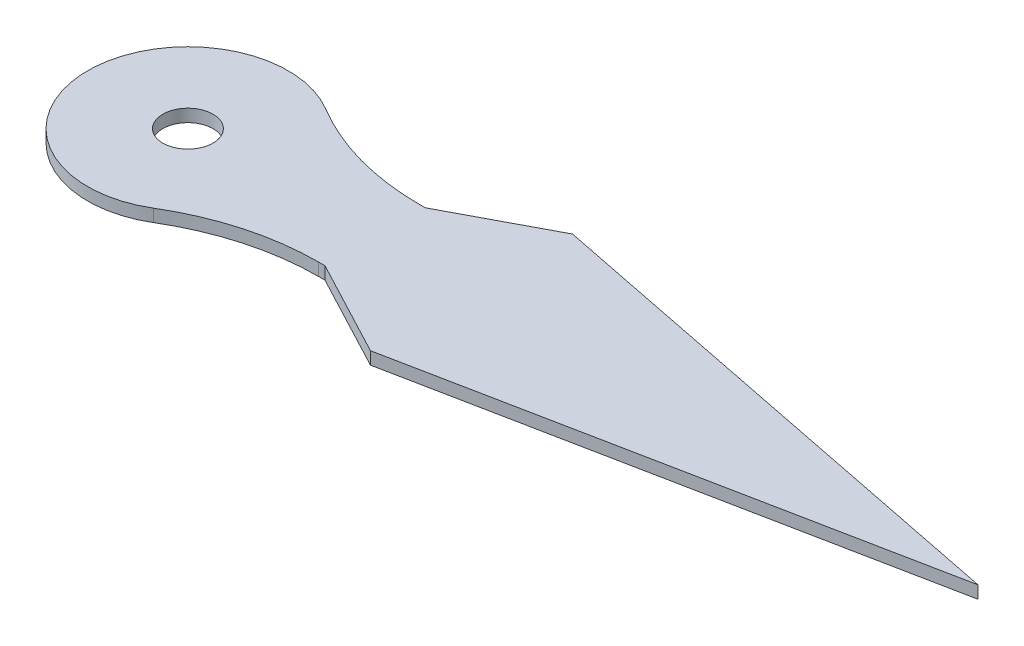
ISO-10303-21;
HEADER;
FILE_DESCRIPTION(('STEP AP214'),'2;1');
FILE_NAME('part.step','',(''),(''),'','','');
FILE_SCHEMA(('AUTOMOTIVE_DESIGN { 1 0 10303 214 1 1 1 1 }'));
ENDSEC;
DATA;
#1=APPLICATION_CONTEXT('core data for automotive mechanical design processes');
#2=APPLICATION_PROTOCOL_DEFINITION('international standard','automotive_design',2000,#1);
#3=PRODUCT_CONTEXT('',#1,'mechanical');
#4=PRODUCT('Part','Part','',(#3));
#5=PRODUCT_RELATED_PRODUCT_CATEGORY('part','',(#4));
#6=PRODUCT_DEFINITION_FORMATION('','',#4);
#7=PRODUCT_DEFINITION_CONTEXT('part definition',#1,'design');
#8=PRODUCT_DEFINITION('design','',#6,#7);
#9=PRODUCT_DEFINITION_SHAPE('','',#8);
#10=(LENGTH_UNIT() NAMED_UNIT(*) SI_UNIT(.MILLI.,.METRE.));
#11=(NAMED_UNIT(*) PLANE_ANGLE_UNIT() SI_UNIT($,.RADIAN.));
#12=(NAMED_UNIT(*) SI_UNIT($,.STERADIAN.) SOLID_ANGLE_UNIT());
#13=UNCERTAINTY_MEASURE_WITH_UNIT(LENGTH_MEASURE(1.E-05),#10,'distance_accuracy_value','');
#14=(GEOMETRIC_REPRESENTATION_CONTEXT(3) GLOBAL_UNCERTAINTY_ASSIGNED_CONTEXT((#13)) GLOBAL_UNIT_ASSIGNED_CONTEXT((#10,
#11,#12)) REPRESENTATION_CONTEXT('',''));
#15=CARTESIAN_POINT('',(0.,0.,0.));
#16=DIRECTION('',(0.,0.,1.));
#17=DIRECTION('',(1.,0.,0.));
#18=AXIS2_PLACEMENT_3D('',#15,#16,#17);
#19=CARTESIAN_POINT('',(0.,0.5,-2.00000000000001));
#20=DIRECTION('',(0.,0.,-1.));
#21=DIRECTION('',(-1.,0.,0.));
#22=AXIS2_PLACEMENT_3D('',#19,#20,#21);
#23=PLANE('',#22);
#24=DIRECTION('',(1.,0.,0.));
#25=VECTOR('',#24,1.);
#26=CARTESIAN_POINT('',(0.,0.,-2.00000000000001));
#27=LINE('',#26,#25);
#28=CARTESIAN_POINT('',(7.21110255092797,0.,-2.));
#29=VERTEX_POINT('',#28);
#30=CARTESIAN_POINT('',(7.46410161513775,0.,-2.));
#31=VERTEX_POINT('',#30);
#32=EDGE_CURVE('E138',#29,#31,#27,.T.);
#33=ORIENTED_EDGE('',*,*,#32,.F.);
#34=DIRECTION('',(0.,-1.,0.));
#35=VECTOR('',#34,1.);
#36=CARTESIAN_POINT('',(7.21110255092797,0.5,-2.));
#37=LINE('',#36,#35);
#38=CARTESIAN_POINT('',(7.21110255092797,0.5,-2.));
#39=VERTEX_POINT('',#38);
#40=EDGE_CURVE('E168',#29,#39,#37,.F.);
#41=ORIENTED_EDGE('',*,*,#40,.T.);
#42=DIRECTION('',(1.,0.,0.));
#43=VECTOR('',#42,1.);
#44=CARTESIAN_POINT('',(0.,0.5,-2.00000000000001));
#45=LINE('',#44,#43);
#46=CARTESIAN_POINT('',(7.46410161513775,0.5,-2.));
#47=VERTEX_POINT('',#46);
#48=EDGE_CURVE('E156',#39,#47,#45,.T.);
#49=ORIENTED_EDGE('',*,*,#48,.T.);
#50=DIRECTION('',(0.,-1.,0.));
#51=VECTOR('',#50,1.);
#52=CARTESIAN_POINT('',(7.46410161513775,0.5,-2.));
#53=LINE('',#52,#51);
#54=EDGE_CURVE('E137',#47,#31,#53,.T.);
#55=ORIENTED_EDGE('',*,*,#54,.T.);
#56=EDGE_LOOP('',(#33,#41,#49,#55));
#57=FACE_BOUND('',#56,.T.);
#58=ADVANCED_FACE('F36',(#57),#23,.T.);
#59=CARTESIAN_POINT('',(0.,0.5,0.));
#60=DIRECTION('',(0.,-1.,0.));
#61=DIRECTION('',(0.,0.,-1.));
#62=AXIS2_PLACEMENT_3D('',#59,#60,#61);
#63=CYLINDRICAL_SURFACE('',#62,4.);
#64=CARTESIAN_POINT('',(0.,0.5,0.));
#65=DIRECTION('',(0.,1.,0.));
#66=DIRECTION('',(0.,0.,1.));
#67=AXIS2_PLACEMENT_3D('',#64,#65,#66);
#68=CIRCLE('',#67,4.);
#69=CARTESIAN_POINT('',(2.06031501455085,0.5,-3.42857142857143));
#70=VERTEX_POINT('',#69);
#71=CARTESIAN_POINT('',(2.06031501455085,0.5,3.42857142857143));
#72=VERTEX_POINT('',#71);
#73=EDGE_CURVE('E111',#70,#72,#68,.T.);
#74=ORIENTED_EDGE('',*,*,#73,.F.);
#75=DIRECTION('',(0.,-1.,0.));
#76=VECTOR('',#75,1.);
#77=CARTESIAN_POINT('',(2.06031501455085,0.5,-3.42857142857143));
#78=LINE('',#77,#76);
#79=CARTESIAN_POINT('',(2.06031501455085,0.,-3.42857142857143));
#80=VERTEX_POINT('',#79);
#81=EDGE_CURVE('E165',#70,#80,#78,.T.);
#82=ORIENTED_EDGE('',*,*,#81,.T.);
#83=CARTESIAN_POINT('',(0.,0.,0.));
#84=DIRECTION('',(0.,1.,0.));
#85=DIRECTION('',(0.,0.,1.));
#86=AXIS2_PLACEMENT_3D('',#83,#84,#85);
#87=CIRCLE('',#86,4.);
#88=CARTESIAN_POINT('',(2.06031501455085,0.,3.42857142857143));
#89=VERTEX_POINT('',#88);
#90=EDGE_CURVE('E140',#80,#89,#87,.T.);
#91=ORIENTED_EDGE('',*,*,#90,.T.);
#92=DIRECTION('',(0.,-1.,0.));
#93=VECTOR('',#92,1.);
#94=CARTESIAN_POINT('',(2.06031501455085,0.5,3.42857142857143));
#95=LINE('',#94,#93);
#96=EDGE_CURVE('E120',#89,#72,#95,.F.);
#97=ORIENTED_EDGE('',*,*,#96,.T.);
#98=EDGE_LOOP('',(#74,#82,#91,#97));
#99=FACE_BOUND('',#98,.T.);
#100=ADVANCED_FACE('F180',(#99),#63,.T.);
#101=CARTESIAN_POINT('',(0.,0.5,2.));
#102=DIRECTION('',(0.,0.,-1.));
#103=DIRECTION('',(-1.,0.,0.));
#104=AXIS2_PLACEMENT_3D('',#101,#102,#103);
#105=PLANE('',#104);
#106=DIRECTION('',(1.,0.,0.));
#107=VECTOR('',#106,1.);
#108=CARTESIAN_POINT('',(0.,0.5,2.));
#109=LINE('',#108,#107);
#110=CARTESIAN_POINT('',(7.21110255092797,0.5,2.));
#111=VERTEX_POINT('',#110);
#112=CARTESIAN_POINT('',(7.46410161513775,0.5,2.00000000000001));
#113=VERTEX_POINT('',#112);
#114=EDGE_CURVE('E103',#111,#113,#109,.T.);
#115=ORIENTED_EDGE('',*,*,#114,.F.);
#116=DIRECTION('',(0.,1.,0.));
#117=VECTOR('',#116,1.);
#118=CARTESIAN_POINT('',(7.21110255092797,0.,2.));
#119=LINE('',#118,#117);
#120=CARTESIAN_POINT('',(7.21110255092797,0.,2.));
#121=VERTEX_POINT('',#120);
#122=EDGE_CURVE('E170',#111,#121,#119,.F.);
#123=ORIENTED_EDGE('',*,*,#122,.T.);
#124=DIRECTION('',(1.,0.,0.));
#125=VECTOR('',#124,1.);
#126=CARTESIAN_POINT('',(0.,0.,2.));
#127=LINE('',#126,#125);
#128=CARTESIAN_POINT('',(7.46410161513775,0.,2.00000000000001));
#129=VERTEX_POINT('',#128);
#130=EDGE_CURVE('E117',#121,#129,#127,.T.);
#131=ORIENTED_EDGE('',*,*,#130,.T.);
#132=DIRECTION('',(0.,-1.,0.));
#133=VECTOR('',#132,1.);
#134=CARTESIAN_POINT('',(7.46410161513775,0.5,2.00000000000001));
#135=LINE('',#134,#133);
#136=EDGE_CURVE('E114',#113,#129,#135,.T.);
#137=ORIENTED_EDGE('',*,*,#136,.F.);
#138=EDGE_LOOP('',(#115,#123,#131,#137));
#139=FACE_BOUND('',#138,.T.);
#140=ADVANCED_FACE('F115',(#139),#105,.F.);
#141=CARTESIAN_POINT('',(0.801892589521018,0.5,-1.51840744270702));
#142=DIRECTION('',(0.46699130377851,0.,-0.884261908144441));
#143=DIRECTION('',(-0.884261908144441,0.,-0.46699130377851));
#144=AXIS2_PLACEMENT_3D('',#141,#142,#143);
#145=PLANE('',#144);
#146=DIRECTION('',(0.884261908144441,0.,0.46699130377851));
#147=VECTOR('',#146,1.);
#148=CARTESIAN_POINT('',(0.801892589521018,0.,-1.51840744270702));
#149=LINE('',#148,#147);
#150=CARTESIAN_POINT('',(11.302617333086,0.,4.02717480328935));
#151=VERTEX_POINT('',#150);
#152=EDGE_CURVE('E145',#129,#151,#149,.T.);
#153=ORIENTED_EDGE('',*,*,#152,.T.);
#154=DIRECTION('',(0.,-1.,0.));
#155=VECTOR('',#154,1.);
#156=CARTESIAN_POINT('',(11.302617333086,0.5,4.02717480328935));
#157=LINE('',#156,#155);
#158=CARTESIAN_POINT('',(11.302617333086,0.5,4.02717480328935));
#159=VERTEX_POINT('',#158);
#160=EDGE_CURVE('E121',#159,#151,#157,.T.);
#161=ORIENTED_EDGE('',*,*,#160,.F.);
#162=DIRECTION('',(0.884261908144441,0.,0.46699130377851));
#163=VECTOR('',#162,1.);
#164=CARTESIAN_POINT('',(0.801892589521018,0.5,-1.51840744270702));
#165=LINE('',#164,#163);
#166=EDGE_CURVE('E108',#113,#159,#165,.T.);
#167=ORIENTED_EDGE('',*,*,#166,.F.);
#168=ORIENTED_EDGE('',*,*,#136,.T.);
#169=EDGE_LOOP('',(#153,#161,#167,#168));
#170=FACE_BOUND('',#169,.T.);
#171=ADVANCED_FACE('F123',(#170),#145,.F.);
#172=CARTESIAN_POINT('',(1.20499180331526,0.5,6.04125300598459));
#173=DIRECTION('',(-0.195607451328278,0.,-0.980682275247623));
#174=DIRECTION('',(-0.980682275247623,0.,0.195607451328278));
#175=AXIS2_PLACEMENT_3D('',#172,#173,#174);
#176=PLANE('',#175);
#177=DIRECTION('',(0.980682275247623,0.,-0.195607451328278));
#178=VECTOR('',#177,1.);
#179=CARTESIAN_POINT('',(1.20499180331526,0.,6.04125300598459));
#180=LINE('',#179,#178);
#181=CARTESIAN_POINT('',(31.4929471088248,0.,0.));
#182=VERTEX_POINT('',#181);
#183=EDGE_CURVE('E147',#151,#182,#180,.T.);
#184=ORIENTED_EDGE('',*,*,#183,.T.);
#185=DIRECTION('',(0.,-1.,0.));
#186=VECTOR('',#185,1.);
#187=CARTESIAN_POINT('',(31.4929471088248,0.5,0.));
#188=LINE('',#187,#186);
#189=CARTESIAN_POINT('',(31.4929471088248,0.5,0.));
#190=VERTEX_POINT('',#189);
#191=EDGE_CURVE('E161',#190,#182,#188,.T.);
#192=ORIENTED_EDGE('',*,*,#191,.F.);
#193=DIRECTION('',(0.980682275247623,0.,-0.195607451328278));
#194=VECTOR('',#193,1.);
#195=CARTESIAN_POINT('',(1.20499180331526,0.5,6.04125300598459));
#196=LINE('',#195,#194);
#197=EDGE_CURVE('E126',#159,#190,#196,.T.);
#198=ORIENTED_EDGE('',*,*,#197,.F.);
#199=ORIENTED_EDGE('',*,*,#160,.T.);
#200=EDGE_LOOP('',(#184,#192,#198,#199));
#201=FACE_BOUND('',#200,.T.);
#202=ADVANCED_FACE('F205',(#201),#176,.F.);
#203=CARTESIAN_POINT('',(1.20499180331526,0.5,-6.04125300598459));
#204=DIRECTION('',(0.195607451328278,0.,-0.980682275247623));
#205=DIRECTION('',(-0.980682275247623,0.,-0.195607451328278));
#206=AXIS2_PLACEMENT_3D('',#203,#204,#205);
#207=PLANE('',#206);
#208=DIRECTION('',(0.980682275247623,0.,0.195607451328278));
#209=VECTOR('',#208,1.);
#210=CARTESIAN_POINT('',(1.20499180331526,0.,-6.04125300598459));
#211=LINE('',#210,#209);
#212=CARTESIAN_POINT('',(11.302617333086,0.,-4.02717480328935));
#213=VERTEX_POINT('',#212);
#214=EDGE_CURVE('E150',#213,#182,#211,.T.);
#215=ORIENTED_EDGE('',*,*,#214,.F.);
#216=DIRECTION('',(0.,-1.,0.));
#217=VECTOR('',#216,1.);
#218=CARTESIAN_POINT('',(11.302617333086,0.5,-4.02717480328935));
#219=LINE('',#218,#217);
#220=CARTESIAN_POINT('',(11.302617333086,0.5,-4.02717480328935));
#221=VERTEX_POINT('',#220);
#222=EDGE_CURVE('E159',#221,#213,#219,.T.);
#223=ORIENTED_EDGE('',*,*,#222,.F.);
#224=DIRECTION('',(0.980682275247623,0.,0.195607451328278));
#225=VECTOR('',#224,1.);
#226=CARTESIAN_POINT('',(1.20499180331526,0.5,-6.04125300598459));
#227=LINE('',#226,#225);
#228=EDGE_CURVE('E128',#221,#190,#227,.T.);
#229=ORIENTED_EDGE('',*,*,#228,.T.);
#230=ORIENTED_EDGE('',*,*,#191,.T.);
#231=EDGE_LOOP('',(#215,#223,#229,#230));
#232=FACE_BOUND('',#231,.T.);
#233=ADVANCED_FACE('F208',(#232),#207,.T.);
#234=CARTESIAN_POINT('',(0.801892589521018,0.5,1.51840744270702));
#235=DIRECTION('',(-0.46699130377851,0.,-0.884261908144441));
#236=DIRECTION('',(-0.884261908144441,0.,0.46699130377851));
#237=AXIS2_PLACEMENT_3D('',#234,#235,#236);
#238=PLANE('',#237);
#239=DIRECTION('',(0.884261908144441,0.,-0.46699130377851));
#240=VECTOR('',#239,1.);
#241=CARTESIAN_POINT('',(0.801892589521018,0.,1.51840744270702));
#242=LINE('',#241,#240);
#243=EDGE_CURVE('E153',#31,#213,#242,.T.);
#244=ORIENTED_EDGE('',*,*,#243,.F.);
#245=ORIENTED_EDGE('',*,*,#54,.F.);
#246=DIRECTION('',(0.884261908144441,0.,-0.46699130377851));
#247=VECTOR('',#246,1.);
#248=CARTESIAN_POINT('',(0.801892589521018,0.5,1.51840744270702));
#249=LINE('',#248,#247);
#250=EDGE_CURVE('E134',#47,#221,#249,.T.);
#251=ORIENTED_EDGE('',*,*,#250,.T.);
#252=ORIENTED_EDGE('',*,*,#222,.T.);
#253=EDGE_LOOP('',(#244,#245,#251,#252));
#254=FACE_BOUND('',#253,.T.);
#255=ADVANCED_FACE('F212',(#254),#238,.T.);
#256=CARTESIAN_POINT('',(0.,0.5,0.));
#257=DIRECTION('',(0.,1.,0.));
#258=DIRECTION('',(0.,0.,1.));
#259=AXIS2_PLACEMENT_3D('',#256,#257,#258);
#260=PLANE('',#259);
#261=CARTESIAN_POINT('',(0.,0.5,0.));
#262=DIRECTION('',(0.,1.,0.));
#263=DIRECTION('',(0.,0.,1.));
#264=AXIS2_PLACEMENT_3D('',#261,#262,#263);
#265=CIRCLE('',#264,1.);
#266=CARTESIAN_POINT('',(0.,0.5,1.));
#267=VERTEX_POINT('',#266);
#268=EDGE_CURVE('E226',#267,#267,#265,.T.);
#269=ORIENTED_EDGE('',*,*,#268,.F.);
#270=EDGE_LOOP('',(#269));
#271=FACE_BOUND('',#270,.T.);
#272=ORIENTED_EDGE('',*,*,#48,.F.);
#273=CARTESIAN_POINT('',(7.21110255092797,0.5,-12.));
#274=DIRECTION('',(0.,1.,0.));
#275=DIRECTION('',(0.,0.,1.));
#276=AXIS2_PLACEMENT_3D('',#273,#274,#275);
#277=CIRCLE('',#276,10.);
#278=EDGE_CURVE('E174',#39,#70,#277,.F.);
#279=ORIENTED_EDGE('',*,*,#278,.T.);
#280=ORIENTED_EDGE('',*,*,#73,.T.);
#281=CARTESIAN_POINT('',(7.21110255092797,0.5,12.));
#282=DIRECTION('',(0.,1.,0.));
#283=DIRECTION('',(0.,0.,1.));
#284=AXIS2_PLACEMENT_3D('',#281,#282,#283);
#285=CIRCLE('',#284,10.);
#286=EDGE_CURVE('E11',#72,#111,#285,.F.);
#287=ORIENTED_EDGE('',*,*,#286,.T.);
#288=ORIENTED_EDGE('',*,*,#114,.T.);
#289=ORIENTED_EDGE('',*,*,#166,.T.);
#290=ORIENTED_EDGE('',*,*,#197,.T.);
#291=ORIENTED_EDGE('',*,*,#228,.F.);
#292=ORIENTED_EDGE('',*,*,#250,.F.);
#293=EDGE_LOOP('',(#272,#279,#280,#287,#288,#289,#290,#291,#292));
#294=FACE_BOUND('',#293,.T.);
#295=ADVANCED_FACE('F106',(#271,#294),#260,.T.);
#296=CARTESIAN_POINT('',(0.,0.,0.));
#297=DIRECTION('',(0.,1.,0.));
#298=DIRECTION('',(0.,0.,1.));
#299=AXIS2_PLACEMENT_3D('',#296,#297,#298);
#300=PLANE('',#299);
#301=CARTESIAN_POINT('',(0.,0.,0.));
#302=DIRECTION('',(0.,1.,0.));
#303=DIRECTION('',(0.,0.,1.));
#304=AXIS2_PLACEMENT_3D('',#301,#302,#303);
#305=CIRCLE('',#304,1.);
#306=CARTESIAN_POINT('',(0.,0.,1.));
#307=VERTEX_POINT('',#306);
#308=EDGE_CURVE('E141',#307,#307,#305,.T.);
#309=ORIENTED_EDGE('',*,*,#308,.T.);
#310=EDGE_LOOP('',(#309));
#311=FACE_BOUND('',#310,.T.);
#312=ORIENTED_EDGE('',*,*,#90,.F.);
#313=CARTESIAN_POINT('',(7.21110255092797,0.,-12.));
#314=DIRECTION('',(0.,1.,0.));
#315=DIRECTION('',(0.,0.,1.));
#316=AXIS2_PLACEMENT_3D('',#313,#314,#315);
#317=CIRCLE('',#316,10.);
#318=EDGE_CURVE('E172',#80,#29,#317,.T.);
#319=ORIENTED_EDGE('',*,*,#318,.T.);
#320=ORIENTED_EDGE('',*,*,#32,.T.);
#321=ORIENTED_EDGE('',*,*,#243,.T.);
#322=ORIENTED_EDGE('',*,*,#214,.T.);
#323=ORIENTED_EDGE('',*,*,#183,.F.);
#324=ORIENTED_EDGE('',*,*,#152,.F.);
#325=ORIENTED_EDGE('',*,*,#130,.F.);
#326=CARTESIAN_POINT('',(7.21110255092797,0.,12.));
#327=DIRECTION('',(0.,1.,0.));
#328=DIRECTION('',(0.,0.,1.));
#329=AXIS2_PLACEMENT_3D('',#326,#327,#328);
#330=CIRCLE('',#329,10.);
#331=EDGE_CURVE('E44',#121,#89,#330,.T.);
#332=ORIENTED_EDGE('',*,*,#331,.T.);
#333=EDGE_LOOP('',(#312,#319,#320,#321,#322,#323,#324,#325,#332));
#334=FACE_BOUND('',#333,.T.);
#335=ADVANCED_FACE('F177',(#311,#334),#300,.F.);
#336=CARTESIAN_POINT('',(7.21110255092797,0.5,-12.));
#337=DIRECTION('',(0.,-1.,0.));
#338=DIRECTION('',(0.,0.,-1.));
#339=AXIS2_PLACEMENT_3D('',#336,#337,#338);
#340=CYLINDRICAL_SURFACE('',#339,10.);
#341=ORIENTED_EDGE('',*,*,#278,.F.);
#342=ORIENTED_EDGE('',*,*,#40,.F.);
#343=ORIENTED_EDGE('',*,*,#318,.F.);
#344=ORIENTED_EDGE('',*,*,#81,.F.);
#345=EDGE_LOOP('',(#341,#342,#343,#344));
#346=FACE_BOUND('',#345,.T.);
#347=ADVANCED_FACE('F184',(#346),#340,.F.);
#348=CARTESIAN_POINT('',(7.21110255092797,0.5,12.));
#349=DIRECTION('',(0.,-1.,0.));
#350=DIRECTION('',(0.,0.,-1.));
#351=AXIS2_PLACEMENT_3D('',#348,#349,#350);
#352=CYLINDRICAL_SURFACE('',#351,10.);
#353=ORIENTED_EDGE('',*,*,#286,.F.);
#354=ORIENTED_EDGE('',*,*,#96,.F.);
#355=ORIENTED_EDGE('',*,*,#331,.F.);
#356=ORIENTED_EDGE('',*,*,#122,.F.);
#357=EDGE_LOOP('',(#353,#354,#355,#356));
#358=FACE_BOUND('',#357,.T.);
#359=ADVANCED_FACE('F38',(#358),#352,.F.);
#360=CARTESIAN_POINT('',(0.,0.,0.));
#361=DIRECTION('',(0.,1.,0.));
#362=DIRECTION('',(0.,0.,1.));
#363=AXIS2_PLACEMENT_3D('',#360,#361,#362);
#364=CYLINDRICAL_SURFACE('',#363,1.);
#365=ORIENTED_EDGE('',*,*,#308,.F.);
#366=EDGE_LOOP('',(#365));
#367=FACE_BOUND('',#366,.T.);
#368=ORIENTED_EDGE('',*,*,#268,.T.);
#369=EDGE_LOOP('',(#368));
#370=FACE_BOUND('',#369,.T.);
#371=ADVANCED_FACE('F183',(#367,#370),#364,.F.);
#372=CLOSED_SHELL('',(#58,#100,#140,#171,#202,#233,#255,#295,#335,#347,#359,#371));
#373=MANIFOLD_SOLID_BREP('B2',#372);
#374=ADVANCED_BREP_SHAPE_REPRESENTATION('',(#18,#373),#14);
#375=SHAPE_DEFINITION_REPRESENTATION(#9,#374);
ENDSEC;
END-ISO-10303-21;
